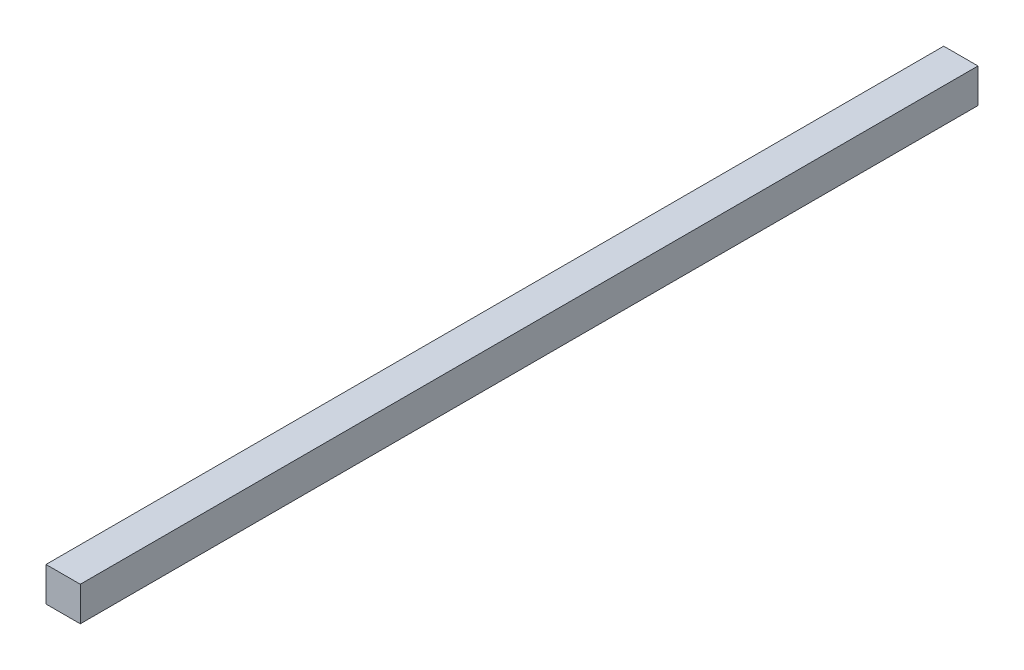
ISO-10303-21;
HEADER;
FILE_DESCRIPTION(('STEP AP214'),'2;1');
FILE_NAME('part.step','',(''),(''),'','','');
FILE_SCHEMA(('AUTOMOTIVE_DESIGN { 1 0 10303 214 1 1 1 1 }'));
ENDSEC;
DATA;
#1=APPLICATION_CONTEXT('core data for automotive mechanical design processes');
#2=APPLICATION_PROTOCOL_DEFINITION('international standard','automotive_design',2000,#1);
#3=PRODUCT_CONTEXT('',#1,'mechanical');
#4=PRODUCT('Part','Part','',(#3));
#5=PRODUCT_RELATED_PRODUCT_CATEGORY('part','',(#4));
#6=PRODUCT_DEFINITION_FORMATION('','',#4);
#7=PRODUCT_DEFINITION_CONTEXT('part definition',#1,'design');
#8=PRODUCT_DEFINITION('design','',#6,#7);
#9=PRODUCT_DEFINITION_SHAPE('','',#8);
#10=(LENGTH_UNIT() NAMED_UNIT(*) SI_UNIT(.MILLI.,.METRE.));
#11=(NAMED_UNIT(*) PLANE_ANGLE_UNIT() SI_UNIT($,.RADIAN.));
#12=(NAMED_UNIT(*) SI_UNIT($,.STERADIAN.) SOLID_ANGLE_UNIT());
#13=UNCERTAINTY_MEASURE_WITH_UNIT(LENGTH_MEASURE(1.E-05),#10,'distance_accuracy_value','');
#14=(GEOMETRIC_REPRESENTATION_CONTEXT(3) GLOBAL_UNCERTAINTY_ASSIGNED_CONTEXT((#13)) GLOBAL_UNIT_ASSIGNED_CONTEXT((#10,
#11,#12)) REPRESENTATION_CONTEXT('',''));
#15=CARTESIAN_POINT('',(0.,0.,0.));
#16=DIRECTION('',(0.,0.,1.));
#17=DIRECTION('',(1.,0.,0.));
#18=AXIS2_PLACEMENT_3D('',#15,#16,#17);
#19=CARTESIAN_POINT('',(-11.,11.,0.));
#20=DIRECTION('',(-1.,0.,0.));
#21=DIRECTION('',(0.,0.,1.));
#22=AXIS2_PLACEMENT_3D('',#19,#20,#21);
#23=PLANE('',#22);
#24=DIRECTION('',(0.,1.,0.));
#25=VECTOR('',#24,1.);
#26=CARTESIAN_POINT('',(-11.,0.,576.));
#27=LINE('',#26,#25);
#28=CARTESIAN_POINT('',(-11.,11.,576.));
#29=VERTEX_POINT('',#28);
#30=CARTESIAN_POINT('',(-11.,-11.,576.));
#31=VERTEX_POINT('',#30);
#32=EDGE_CURVE('E68',#29,#31,#27,.F.);
#33=ORIENTED_EDGE('',*,*,#32,.F.);
#34=DIRECTION('',(0.,0.,1.));
#35=VECTOR('',#34,1.);
#36=CARTESIAN_POINT('',(-11.,11.,0.));
#37=LINE('',#36,#35);
#38=CARTESIAN_POINT('',(-11.,11.,0.));
#39=VERTEX_POINT('',#38);
#40=EDGE_CURVE('E55',#39,#29,#37,.T.);
#41=ORIENTED_EDGE('',*,*,#40,.F.);
#42=DIRECTION('',(0.,1.,0.));
#43=VECTOR('',#42,1.);
#44=CARTESIAN_POINT('',(-11.,0.,0.));
#45=LINE('',#44,#43);
#46=CARTESIAN_POINT('',(-11.,-11.,0.));
#47=VERTEX_POINT('',#46);
#48=EDGE_CURVE('E20',#39,#47,#45,.F.);
#49=ORIENTED_EDGE('',*,*,#48,.T.);
#50=DIRECTION('',(0.,0.,-1.));
#51=VECTOR('',#50,1.);
#52=CARTESIAN_POINT('',(-11.,-11.,0.));
#53=LINE('',#52,#51);
#54=EDGE_CURVE('E81',#31,#47,#53,.T.);
#55=ORIENTED_EDGE('',*,*,#54,.F.);
#56=EDGE_LOOP('',(#33,#41,#49,#55));
#57=FACE_BOUND('',#56,.T.);
#58=ADVANCED_FACE('F17',(#57),#23,.T.);
#59=CARTESIAN_POINT('',(0.,0.,0.));
#60=DIRECTION('',(0.,0.,1.));
#61=DIRECTION('',(1.,0.,0.));
#62=AXIS2_PLACEMENT_3D('',#59,#60,#61);
#63=PLANE('',#62);
#64=DIRECTION('',(0.,1.,0.));
#65=VECTOR('',#64,1.);
#66=CARTESIAN_POINT('',(11.,-11.,0.));
#67=LINE('',#66,#65);
#68=CARTESIAN_POINT('',(11.,-11.,0.));
#69=VERTEX_POINT('',#68);
#70=CARTESIAN_POINT('',(11.,11.,0.));
#71=VERTEX_POINT('',#70);
#72=EDGE_CURVE('E83',#69,#71,#67,.T.);
#73=ORIENTED_EDGE('',*,*,#72,.F.);
#74=DIRECTION('',(1.,0.,0.));
#75=VECTOR('',#74,1.);
#76=CARTESIAN_POINT('',(-11.,-11.,0.));
#77=LINE('',#76,#75);
#78=EDGE_CURVE('E64',#47,#69,#77,.T.);
#79=ORIENTED_EDGE('',*,*,#78,.F.);
#80=ORIENTED_EDGE('',*,*,#48,.F.);
#81=DIRECTION('',(1.,0.,0.));
#82=VECTOR('',#81,1.);
#83=CARTESIAN_POINT('',(11.,11.,0.));
#84=LINE('',#83,#82);
#85=EDGE_CURVE('E61',#71,#39,#84,.F.);
#86=ORIENTED_EDGE('',*,*,#85,.F.);
#87=EDGE_LOOP('',(#73,#79,#80,#86));
#88=FACE_BOUND('',#87,.T.);
#89=ADVANCED_FACE('F60',(#88),#63,.F.);
#90=CARTESIAN_POINT('',(11.,11.,0.));
#91=DIRECTION('',(0.,1.,0.));
#92=DIRECTION('',(0.,0.,1.));
#93=AXIS2_PLACEMENT_3D('',#90,#91,#92);
#94=PLANE('',#93);
#95=DIRECTION('',(1.,0.,0.));
#96=VECTOR('',#95,1.);
#97=CARTESIAN_POINT('',(0.,11.,576.));
#98=LINE('',#97,#96);
#99=CARTESIAN_POINT('',(11.,11.,576.));
#100=VERTEX_POINT('',#99);
#101=EDGE_CURVE('E70',#100,#29,#98,.F.);
#102=ORIENTED_EDGE('',*,*,#101,.F.);
#103=DIRECTION('',(0.,0.,1.));
#104=VECTOR('',#103,1.);
#105=CARTESIAN_POINT('',(11.,11.,0.));
#106=LINE('',#105,#104);
#107=EDGE_CURVE('E74',#71,#100,#106,.T.);
#108=ORIENTED_EDGE('',*,*,#107,.F.);
#109=ORIENTED_EDGE('',*,*,#85,.T.);
#110=ORIENTED_EDGE('',*,*,#40,.T.);
#111=EDGE_LOOP('',(#102,#108,#109,#110));
#112=FACE_BOUND('',#111,.T.);
#113=ADVANCED_FACE('F72',(#112),#94,.T.);
#114=CARTESIAN_POINT('',(0.,0.,576.));
#115=DIRECTION('',(0.,0.,1.));
#116=DIRECTION('',(1.,0.,0.));
#117=AXIS2_PLACEMENT_3D('',#114,#115,#116);
#118=PLANE('',#117);
#119=DIRECTION('',(1.,0.,0.));
#120=VECTOR('',#119,1.);
#121=CARTESIAN_POINT('',(-11.,-11.,576.));
#122=LINE('',#121,#120);
#123=CARTESIAN_POINT('',(11.,-11.,576.));
#124=VERTEX_POINT('',#123);
#125=EDGE_CURVE('E35',#124,#31,#122,.F.);
#126=ORIENTED_EDGE('',*,*,#125,.F.);
#127=DIRECTION('',(0.,1.,0.));
#128=VECTOR('',#127,1.);
#129=CARTESIAN_POINT('',(11.,-11.,576.));
#130=LINE('',#129,#128);
#131=EDGE_CURVE('E26',#100,#124,#130,.F.);
#132=ORIENTED_EDGE('',*,*,#131,.F.);
#133=ORIENTED_EDGE('',*,*,#101,.T.);
#134=ORIENTED_EDGE('',*,*,#32,.T.);
#135=EDGE_LOOP('',(#126,#132,#133,#134));
#136=FACE_BOUND('',#135,.T.);
#137=ADVANCED_FACE('F89',(#136),#118,.T.);
#138=CARTESIAN_POINT('',(-11.,-11.,0.));
#139=DIRECTION('',(0.,-1.,0.));
#140=DIRECTION('',(0.,0.,-1.));
#141=AXIS2_PLACEMENT_3D('',#138,#139,#140);
#142=PLANE('',#141);
#143=ORIENTED_EDGE('',*,*,#125,.T.);
#144=ORIENTED_EDGE('',*,*,#54,.T.);
#145=ORIENTED_EDGE('',*,*,#78,.T.);
#146=DIRECTION('',(0.,0.,1.));
#147=VECTOR('',#146,1.);
#148=CARTESIAN_POINT('',(11.,-11.,0.));
#149=LINE('',#148,#147);
#150=EDGE_CURVE('E11',#124,#69,#149,.F.);
#151=ORIENTED_EDGE('',*,*,#150,.F.);
#152=EDGE_LOOP('',(#143,#144,#145,#151));
#153=FACE_BOUND('',#152,.T.);
#154=ADVANCED_FACE('F91',(#153),#142,.T.);
#155=CARTESIAN_POINT('',(11.,-11.,0.));
#156=DIRECTION('',(1.,0.,0.));
#157=DIRECTION('',(0.,1.,0.));
#158=AXIS2_PLACEMENT_3D('',#155,#156,#157);
#159=PLANE('',#158);
#160=ORIENTED_EDGE('',*,*,#131,.T.);
#161=ORIENTED_EDGE('',*,*,#150,.T.);
#162=ORIENTED_EDGE('',*,*,#72,.T.);
#163=ORIENTED_EDGE('',*,*,#107,.T.);
#164=EDGE_LOOP('',(#160,#161,#162,#163));
#165=FACE_BOUND('',#164,.T.);
#166=ADVANCED_FACE('F88',(#165),#159,.T.);
#167=CLOSED_SHELL('',(#58,#89,#113,#137,#154,#166));
#168=MANIFOLD_SOLID_BREP('B1',#167);
#169=ADVANCED_BREP_SHAPE_REPRESENTATION('',(#18,#168),#14);
#170=SHAPE_DEFINITION_REPRESENTATION(#9,#169);
ENDSEC;
END-ISO-10303-21;
